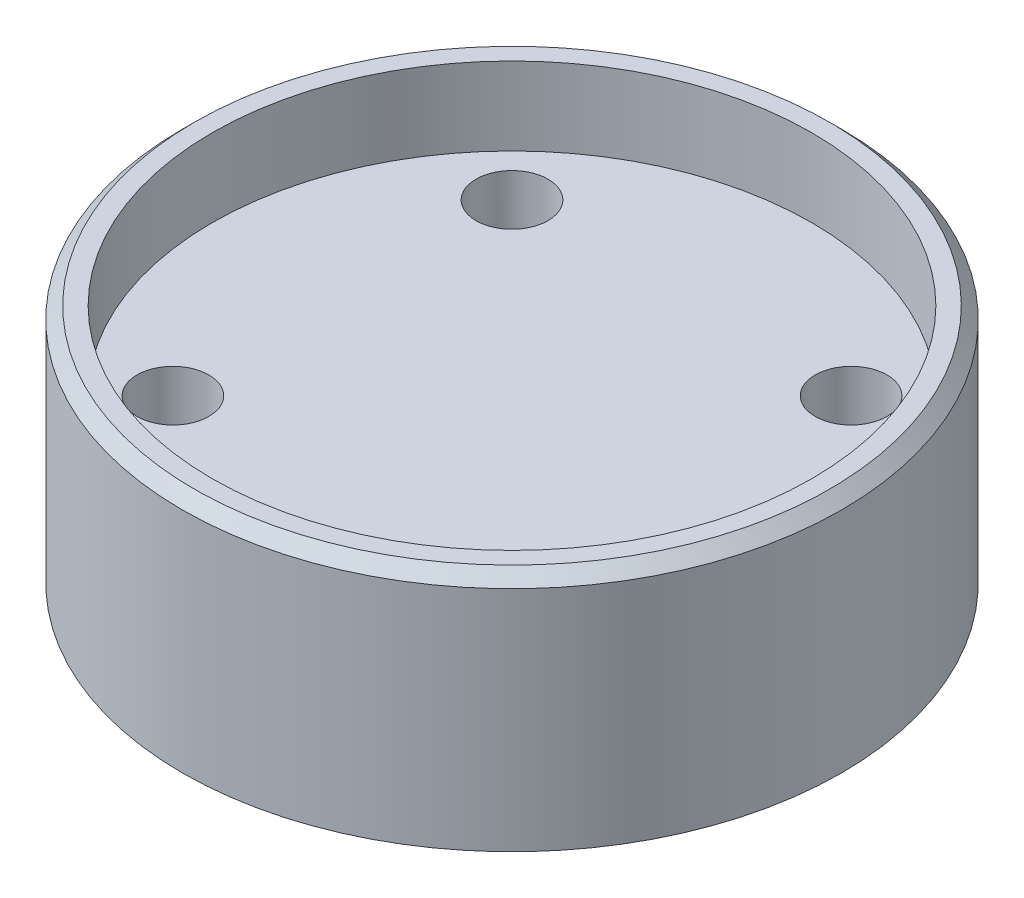
ISO-10303-21;
HEADER;
FILE_DESCRIPTION(('STEP AP214'),'2;1');
FILE_NAME('part.step','',(''),(''),'','','');
FILE_SCHEMA(('AUTOMOTIVE_DESIGN { 1 0 10303 214 1 1 1 1 }'));
ENDSEC;
DATA;
#1=APPLICATION_CONTEXT('core data for automotive mechanical design processes');
#2=APPLICATION_PROTOCOL_DEFINITION('international standard','automotive_design',2000,#1);
#3=PRODUCT_CONTEXT('',#1,'mechanical');
#4=PRODUCT('Part','Part','',(#3));
#5=PRODUCT_RELATED_PRODUCT_CATEGORY('part','',(#4));
#6=PRODUCT_DEFINITION_FORMATION('','',#4);
#7=PRODUCT_DEFINITION_CONTEXT('part definition',#1,'design');
#8=PRODUCT_DEFINITION('design','',#6,#7);
#9=PRODUCT_DEFINITION_SHAPE('','',#8);
#10=(LENGTH_UNIT() NAMED_UNIT(*) SI_UNIT(.MILLI.,.METRE.));
#11=(NAMED_UNIT(*) PLANE_ANGLE_UNIT() SI_UNIT($,.RADIAN.));
#12=(NAMED_UNIT(*) SI_UNIT($,.STERADIAN.) SOLID_ANGLE_UNIT());
#13=UNCERTAINTY_MEASURE_WITH_UNIT(LENGTH_MEASURE(1.E-05),#10,'distance_accuracy_value','');
#14=(GEOMETRIC_REPRESENTATION_CONTEXT(3) GLOBAL_UNCERTAINTY_ASSIGNED_CONTEXT((#13)) GLOBAL_UNIT_ASSIGNED_CONTEXT((#10,
#11,#12)) REPRESENTATION_CONTEXT('',''));
#15=CARTESIAN_POINT('',(0.,0.,0.));
#16=DIRECTION('',(0.,0.,1.));
#17=DIRECTION('',(1.,0.,0.));
#18=AXIS2_PLACEMENT_3D('',#15,#16,#17);
#19=CARTESIAN_POINT('',(27.4999999999999,0.,0.));
#20=DIRECTION('',(0.,-1.,0.));
#21=DIRECTION('',(1.,0.,0.));
#22=AXIS2_PLACEMENT_3D('',#19,#20,#21);
#23=PLANE('',#22);
#24=CARTESIAN_POINT('',(-14.1421356237309,0.,14.1421356237309));
#25=DIRECTION('',(0.,-1.,0.));
#26=DIRECTION('',(1.,0.,0.));
#27=AXIS2_PLACEMENT_3D('',#24,#25,#26);
#28=CIRCLE('',#27,3.);
#29=CARTESIAN_POINT('',(-11.1421356237309,0.,14.1421356237309));
#30=VERTEX_POINT('',#29);
#31=EDGE_CURVE('E55',#30,#30,#28,.T.);
#32=ORIENTED_EDGE('',*,*,#31,.F.);
#33=EDGE_LOOP('',(#32));
#34=FACE_BOUND('',#33,.T.);
#35=CARTESIAN_POINT('',(14.142135623731,0.,14.1421356237309));
#36=DIRECTION('',(0.,-1.,0.));
#37=DIRECTION('',(1.,0.,0.));
#38=AXIS2_PLACEMENT_3D('',#35,#36,#37);
#39=CIRCLE('',#38,3.);
#40=CARTESIAN_POINT('',(17.142135623731,0.,14.1421356237309));
#41=VERTEX_POINT('',#40);
#42=EDGE_CURVE('E56',#41,#41,#39,.T.);
#43=ORIENTED_EDGE('',*,*,#42,.F.);
#44=EDGE_LOOP('',(#43));
#45=FACE_BOUND('',#44,.T.);
#46=CARTESIAN_POINT('',(14.142135623731,0.,-14.142135623731));
#47=DIRECTION('',(0.,-1.,0.));
#48=DIRECTION('',(1.,0.,0.));
#49=AXIS2_PLACEMENT_3D('',#46,#47,#48);
#50=CIRCLE('',#49,3.);
#51=CARTESIAN_POINT('',(17.142135623731,0.,-14.142135623731));
#52=VERTEX_POINT('',#51);
#53=EDGE_CURVE('E60',#52,#52,#50,.T.);
#54=ORIENTED_EDGE('',*,*,#53,.F.);
#55=EDGE_LOOP('',(#54));
#56=FACE_BOUND('',#55,.T.);
#57=CARTESIAN_POINT('',(-14.1421356237309,0.,-14.142135623731));
#58=DIRECTION('',(0.,-1.,0.));
#59=DIRECTION('',(1.,0.,0.));
#60=AXIS2_PLACEMENT_3D('',#57,#58,#59);
#61=CIRCLE('',#60,3.);
#62=CARTESIAN_POINT('',(-11.1421356237309,0.,-14.142135623731));
#63=VERTEX_POINT('',#62);
#64=EDGE_CURVE('E64',#63,#63,#61,.T.);
#65=ORIENTED_EDGE('',*,*,#64,.F.);
#66=EDGE_LOOP('',(#65));
#67=FACE_BOUND('',#66,.T.);
#68=CARTESIAN_POINT('',(0.,-1.11022302462516E-13,0.));
#69=DIRECTION('',(0.,-1.,0.));
#70=DIRECTION('',(1.,0.,0.));
#71=AXIS2_PLACEMENT_3D('',#68,#69,#70);
#72=CIRCLE('',#71,27.4999999999999);
#73=CARTESIAN_POINT('',(27.4999999999999,0.,0.));
#74=VERTEX_POINT('',#73);
#75=EDGE_CURVE('E45',#74,#74,#72,.T.);
#76=ORIENTED_EDGE('',*,*,#75,.T.);
#77=EDGE_LOOP('',(#76));
#78=FACE_BOUND('',#77,.T.);
#79=ADVANCED_FACE('F33',(#34,#45,#56,#67,#78),#23,.T.);
#80=CARTESIAN_POINT('',(2.14969366173535E-12,-626.687351977546,0.));
#81=DIRECTION('',(0.,-1.,0.));
#82=DIRECTION('',(1.,0.,0.));
#83=AXIS2_PLACEMENT_3D('',#80,#81,#82);
#84=CYLINDRICAL_SURFACE('',#83,27.5);
#85=CARTESIAN_POINT('',(0.,18.9999999999999,0.));
#86=DIRECTION('',(0.,1.,0.));
#87=DIRECTION('',(-1.,0.,0.));
#88=AXIS2_PLACEMENT_3D('',#85,#86,#87);
#89=CIRCLE('',#88,27.5);
#90=CARTESIAN_POINT('',(-27.5000000000001,18.9999999999998,0.));
#91=VERTEX_POINT('',#90);
#92=EDGE_CURVE('E41',#91,#91,#89,.F.);
#93=ORIENTED_EDGE('',*,*,#92,.T.);
#94=EDGE_LOOP('',(#93));
#95=FACE_BOUND('',#94,.T.);
#96=ORIENTED_EDGE('',*,*,#75,.F.);
#97=EDGE_LOOP('',(#96));
#98=FACE_BOUND('',#97,.T.);
#99=ADVANCED_FACE('F87',(#95,#98),#84,.T.);
#100=CARTESIAN_POINT('',(27.5,20.,0.));
#101=DIRECTION('',(0.,1.,0.));
#102=DIRECTION('',(-1.,0.,0.));
#103=AXIS2_PLACEMENT_3D('',#100,#101,#102);
#104=PLANE('',#103);
#105=CARTESIAN_POINT('',(0.,19.9999999999999,0.));
#106=DIRECTION('',(0.,1.,0.));
#107=DIRECTION('',(-1.,0.,0.));
#108=AXIS2_PLACEMENT_3D('',#105,#106,#107);
#109=CIRCLE('',#108,26.5);
#110=CARTESIAN_POINT('',(-26.5,19.9999999999998,0.));
#111=VERTEX_POINT('',#110);
#112=EDGE_CURVE('E10',#111,#111,#109,.T.);
#113=ORIENTED_EDGE('',*,*,#112,.T.);
#114=EDGE_LOOP('',(#113));
#115=FACE_BOUND('',#114,.T.);
#116=CARTESIAN_POINT('',(0.,19.9999999999999,0.));
#117=DIRECTION('',(0.,-1.,0.));
#118=DIRECTION('',(1.,0.,0.));
#119=AXIS2_PLACEMENT_3D('',#116,#117,#118);
#120=CIRCLE('',#119,25.0000000000001);
#121=CARTESIAN_POINT('',(25.,20.,0.));
#122=VERTEX_POINT('',#121);
#123=EDGE_CURVE('E49',#122,#122,#120,.T.);
#124=ORIENTED_EDGE('',*,*,#123,.T.);
#125=EDGE_LOOP('',(#124));
#126=FACE_BOUND('',#125,.T.);
#127=ADVANCED_FACE('F92',(#115,#126),#104,.T.);
#128=CARTESIAN_POINT('',(2.14969366173535E-12,-626.687351977546,0.));
#129=DIRECTION('',(0.,-1.,0.));
#130=DIRECTION('',(1.,0.,0.));
#131=AXIS2_PLACEMENT_3D('',#128,#129,#130);
#132=CYLINDRICAL_SURFACE('',#131,25.0000000000001);
#133=CARTESIAN_POINT('',(0.,13.4999999999998,0.));
#134=DIRECTION('',(0.,-1.,0.));
#135=DIRECTION('',(1.,0.,0.));
#136=AXIS2_PLACEMENT_3D('',#133,#134,#135);
#137=CIRCLE('',#136,25.);
#138=CARTESIAN_POINT('',(25.,13.4999999999999,0.));
#139=VERTEX_POINT('',#138);
#140=EDGE_CURVE('E70',#139,#139,#137,.T.);
#141=ORIENTED_EDGE('',*,*,#140,.T.);
#142=EDGE_LOOP('',(#141));
#143=FACE_BOUND('',#142,.T.);
#144=ORIENTED_EDGE('',*,*,#123,.F.);
#145=EDGE_LOOP('',(#144));
#146=FACE_BOUND('',#145,.T.);
#147=ADVANCED_FACE('F97',(#143,#146),#132,.F.);
#148=CARTESIAN_POINT('',(25.,13.5,0.));
#149=DIRECTION('',(0.,1.,0.));
#150=DIRECTION('',(-1.,0.,0.));
#151=AXIS2_PLACEMENT_3D('',#148,#149,#150);
#152=PLANE('',#151);
#153=CARTESIAN_POINT('',(-14.1421356237309,13.4999999999999,14.1421356237309));
#154=DIRECTION('',(0.,1.,0.));
#155=DIRECTION('',(-1.,0.,0.));
#156=AXIS2_PLACEMENT_3D('',#153,#154,#155);
#157=CIRCLE('',#156,3.);
#158=CARTESIAN_POINT('',(-17.1421356237309,13.4999999999999,14.1421356237309));
#159=VERTEX_POINT('',#158);
#160=EDGE_CURVE('E52',#159,#159,#157,.T.);
#161=ORIENTED_EDGE('',*,*,#160,.F.);
#162=EDGE_LOOP('',(#161));
#163=FACE_BOUND('',#162,.T.);
#164=CARTESIAN_POINT('',(14.142135623731,13.5,14.1421356237309));
#165=DIRECTION('',(0.,1.,0.));
#166=DIRECTION('',(-1.,0.,0.));
#167=AXIS2_PLACEMENT_3D('',#164,#165,#166);
#168=CIRCLE('',#167,3.);
#169=CARTESIAN_POINT('',(11.142135623731,13.5,14.1421356237309));
#170=VERTEX_POINT('',#169);
#171=EDGE_CURVE('E57',#170,#170,#168,.T.);
#172=ORIENTED_EDGE('',*,*,#171,.F.);
#173=EDGE_LOOP('',(#172));
#174=FACE_BOUND('',#173,.T.);
#175=CARTESIAN_POINT('',(14.142135623731,13.5,-14.142135623731));
#176=DIRECTION('',(0.,1.,0.));
#177=DIRECTION('',(-1.,0.,0.));
#178=AXIS2_PLACEMENT_3D('',#175,#176,#177);
#179=CIRCLE('',#178,3.);
#180=CARTESIAN_POINT('',(11.142135623731,13.5,-14.142135623731));
#181=VERTEX_POINT('',#180);
#182=EDGE_CURVE('E61',#181,#181,#179,.T.);
#183=ORIENTED_EDGE('',*,*,#182,.F.);
#184=EDGE_LOOP('',(#183));
#185=FACE_BOUND('',#184,.T.);
#186=CARTESIAN_POINT('',(-14.1421356237309,13.4999999999999,-14.142135623731));
#187=DIRECTION('',(0.,1.,0.));
#188=DIRECTION('',(-1.,0.,0.));
#189=AXIS2_PLACEMENT_3D('',#186,#187,#188);
#190=CIRCLE('',#189,3.);
#191=CARTESIAN_POINT('',(-17.1421356237309,13.4999999999999,-14.142135623731));
#192=VERTEX_POINT('',#191);
#193=EDGE_CURVE('E65',#192,#192,#190,.T.);
#194=ORIENTED_EDGE('',*,*,#193,.F.);
#195=EDGE_LOOP('',(#194));
#196=FACE_BOUND('',#195,.T.);
#197=ORIENTED_EDGE('',*,*,#140,.F.);
#198=EDGE_LOOP('',(#197));
#199=FACE_BOUND('',#198,.T.);
#200=ADVANCED_FACE('F102',(#163,#174,#185,#196,#199),#152,.T.);
#201=CARTESIAN_POINT('',(-14.1421356237309,-1.2E-05,-14.142135623731));
#202=DIRECTION('',(0.,1.,0.));
#203=DIRECTION('',(0.,0.,1.));
#204=AXIS2_PLACEMENT_3D('',#201,#202,#203);
#205=CYLINDRICAL_SURFACE('',#204,3.);
#206=ORIENTED_EDGE('',*,*,#64,.T.);
#207=EDGE_LOOP('',(#206));
#208=FACE_BOUND('',#207,.T.);
#209=ORIENTED_EDGE('',*,*,#193,.T.);
#210=EDGE_LOOP('',(#209));
#211=FACE_BOUND('',#210,.T.);
#212=ADVANCED_FACE('F82',(#208,#211),#205,.F.);
#213=CARTESIAN_POINT('',(14.142135623731,-1.2E-05,-14.142135623731));
#214=DIRECTION('',(0.,1.,0.));
#215=DIRECTION('',(0.,0.,1.));
#216=AXIS2_PLACEMENT_3D('',#213,#214,#215);
#217=CYLINDRICAL_SURFACE('',#216,3.);
#218=ORIENTED_EDGE('',*,*,#53,.T.);
#219=EDGE_LOOP('',(#218));
#220=FACE_BOUND('',#219,.T.);
#221=ORIENTED_EDGE('',*,*,#182,.T.);
#222=EDGE_LOOP('',(#221));
#223=FACE_BOUND('',#222,.T.);
#224=ADVANCED_FACE('F109',(#220,#223),#217,.F.);
#225=CARTESIAN_POINT('',(14.142135623731,-1.2E-05,14.1421356237309));
#226=DIRECTION('',(0.,1.,0.));
#227=DIRECTION('',(0.,0.,1.));
#228=AXIS2_PLACEMENT_3D('',#225,#226,#227);
#229=CYLINDRICAL_SURFACE('',#228,3.);
#230=ORIENTED_EDGE('',*,*,#42,.T.);
#231=EDGE_LOOP('',(#230));
#232=FACE_BOUND('',#231,.T.);
#233=ORIENTED_EDGE('',*,*,#171,.T.);
#234=EDGE_LOOP('',(#233));
#235=FACE_BOUND('',#234,.T.);
#236=ADVANCED_FACE('F113',(#232,#235),#229,.F.);
#237=CARTESIAN_POINT('',(-14.1421356237309,-1.2E-05,14.1421356237309));
#238=DIRECTION('',(0.,1.,0.));
#239=DIRECTION('',(0.,0.,1.));
#240=AXIS2_PLACEMENT_3D('',#237,#238,#239);
#241=CYLINDRICAL_SURFACE('',#240,3.);
#242=ORIENTED_EDGE('',*,*,#31,.T.);
#243=EDGE_LOOP('',(#242));
#244=FACE_BOUND('',#243,.T.);
#245=ORIENTED_EDGE('',*,*,#160,.T.);
#246=EDGE_LOOP('',(#245));
#247=FACE_BOUND('',#246,.T.);
#248=ADVANCED_FACE('F110',(#244,#247),#241,.F.);
#249=CARTESIAN_POINT('',(0.,18.9999999999999,0.));
#250=DIRECTION('',(0.,-1.,0.));
#251=DIRECTION('',(1.,0.,0.));
#252=AXIS2_PLACEMENT_3D('',#249,#250,#251);
#253=CONICAL_SURFACE('',#252,27.5,0.78539816339746);
#254=ORIENTED_EDGE('',*,*,#112,.F.);
#255=EDGE_LOOP('',(#254));
#256=FACE_BOUND('',#255,.T.);
#257=ORIENTED_EDGE('',*,*,#92,.F.);
#258=EDGE_LOOP('',(#257));
#259=FACE_BOUND('',#258,.T.);
#260=ADVANCED_FACE('F36',(#256,#259),#253,.T.);
#261=CLOSED_SHELL('',(#79,#99,#127,#147,#200,#212,#224,#236,#248,#260));
#262=MANIFOLD_SOLID_BREP('B2',#261);
#263=ADVANCED_BREP_SHAPE_REPRESENTATION('',(#18,#262),#14);
#264=SHAPE_DEFINITION_REPRESENTATION(#9,#263);
ENDSEC;
END-ISO-10303-21;
